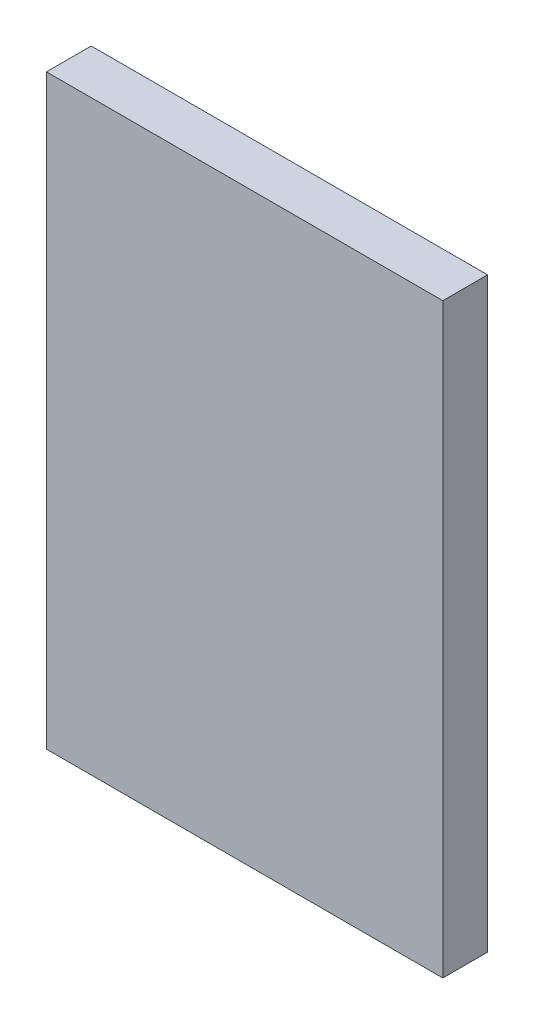
ISO-10303-21;
HEADER;
FILE_DESCRIPTION(('STEP AP214'),'2;1');
FILE_NAME('part.step','',(''),(''),'','','');
FILE_SCHEMA(('AUTOMOTIVE_DESIGN { 1 0 10303 214 1 1 1 1 }'));
ENDSEC;
DATA;
#1=APPLICATION_CONTEXT('core data for automotive mechanical design processes');
#2=APPLICATION_PROTOCOL_DEFINITION('international standard','automotive_design',2000,#1);
#3=PRODUCT_CONTEXT('',#1,'mechanical');
#4=PRODUCT('Part','Part','',(#3));
#5=PRODUCT_RELATED_PRODUCT_CATEGORY('part','',(#4));
#6=PRODUCT_DEFINITION_FORMATION('','',#4);
#7=PRODUCT_DEFINITION_CONTEXT('part definition',#1,'design');
#8=PRODUCT_DEFINITION('design','',#6,#7);
#9=PRODUCT_DEFINITION_SHAPE('','',#8);
#10=(LENGTH_UNIT() NAMED_UNIT(*) SI_UNIT(.MILLI.,.METRE.));
#11=(NAMED_UNIT(*) PLANE_ANGLE_UNIT() SI_UNIT($,.RADIAN.));
#12=(NAMED_UNIT(*) SI_UNIT($,.STERADIAN.) SOLID_ANGLE_UNIT());
#13=UNCERTAINTY_MEASURE_WITH_UNIT(LENGTH_MEASURE(1.E-05),#10,'distance_accuracy_value','');
#14=(GEOMETRIC_REPRESENTATION_CONTEXT(3) GLOBAL_UNCERTAINTY_ASSIGNED_CONTEXT((#13)) GLOBAL_UNIT_ASSIGNED_CONTEXT((#10,
#11,#12)) REPRESENTATION_CONTEXT('',''));
#15=CARTESIAN_POINT('',(0.,0.,0.));
#16=DIRECTION('',(0.,0.,1.));
#17=DIRECTION('',(1.,0.,0.));
#18=AXIS2_PLACEMENT_3D('',#15,#16,#17);
#19=CARTESIAN_POINT('',(225.,333.,50.8));
#20=DIRECTION('',(-1.,0.,0.));
#21=DIRECTION('',(0.,-1.,0.));
#22=AXIS2_PLACEMENT_3D('',#19,#20,#21);
#23=PLANE('',#22);
#24=DIRECTION('',(0.,1.,0.));
#25=VECTOR('',#24,1.);
#26=CARTESIAN_POINT('',(225.,333.,0.));
#27=LINE('',#26,#25);
#28=CARTESIAN_POINT('',(225.,-333.,0.));
#29=VERTEX_POINT('',#28);
#30=CARTESIAN_POINT('',(225.,333.,0.));
#31=VERTEX_POINT('',#30);
#32=EDGE_CURVE('E96',#29,#31,#27,.T.);
#33=ORIENTED_EDGE('',*,*,#32,.T.);
#34=DIRECTION('',(0.,0.,-1.));
#35=VECTOR('',#34,1.);
#36=CARTESIAN_POINT('',(225.,333.,50.8));
#37=LINE('',#36,#35);
#38=CARTESIAN_POINT('',(225.,333.,50.8));
#39=VERTEX_POINT('',#38);
#40=EDGE_CURVE('E11',#39,#31,#37,.T.);
#41=ORIENTED_EDGE('',*,*,#40,.F.);
#42=DIRECTION('',(0.,1.,0.));
#43=VECTOR('',#42,1.);
#44=CARTESIAN_POINT('',(225.,333.,50.8));
#45=LINE('',#44,#43);
#46=CARTESIAN_POINT('',(225.,-333.,50.8));
#47=VERTEX_POINT('',#46);
#48=EDGE_CURVE('E84',#47,#39,#45,.T.);
#49=ORIENTED_EDGE('',*,*,#48,.F.);
#50=DIRECTION('',(0.,0.,-1.));
#51=VECTOR('',#50,1.);
#52=CARTESIAN_POINT('',(225.,-333.,50.8));
#53=LINE('',#52,#51);
#54=EDGE_CURVE('E92',#47,#29,#53,.T.);
#55=ORIENTED_EDGE('',*,*,#54,.T.);
#56=EDGE_LOOP('',(#33,#41,#49,#55));
#57=FACE_BOUND('',#56,.T.);
#58=ADVANCED_FACE('F33',(#57),#23,.F.);
#59=CARTESIAN_POINT('',(-225.,333.,50.8));
#60=DIRECTION('',(0.,-1.,0.));
#61=DIRECTION('',(0.,0.,-1.));
#62=AXIS2_PLACEMENT_3D('',#59,#60,#61);
#63=PLANE('',#62);
#64=DIRECTION('',(-1.,0.,0.));
#65=VECTOR('',#64,1.);
#66=CARTESIAN_POINT('',(-225.,333.,0.));
#67=LINE('',#66,#65);
#68=CARTESIAN_POINT('',(-225.,333.,0.));
#69=VERTEX_POINT('',#68);
#70=EDGE_CURVE('E88',#31,#69,#67,.T.);
#71=ORIENTED_EDGE('',*,*,#70,.T.);
#72=DIRECTION('',(0.,0.,-1.));
#73=VECTOR('',#72,1.);
#74=CARTESIAN_POINT('',(-225.,333.,50.8));
#75=LINE('',#74,#73);
#76=CARTESIAN_POINT('',(-225.,333.,50.8));
#77=VERTEX_POINT('',#76);
#78=EDGE_CURVE('E41',#77,#69,#75,.T.);
#79=ORIENTED_EDGE('',*,*,#78,.F.);
#80=DIRECTION('',(-1.,0.,0.));
#81=VECTOR('',#80,1.);
#82=CARTESIAN_POINT('',(-225.,333.,50.8));
#83=LINE('',#82,#81);
#84=EDGE_CURVE('E79',#39,#77,#83,.T.);
#85=ORIENTED_EDGE('',*,*,#84,.F.);
#86=ORIENTED_EDGE('',*,*,#40,.T.);
#87=EDGE_LOOP('',(#71,#79,#85,#86));
#88=FACE_BOUND('',#87,.T.);
#89=ADVANCED_FACE('F87',(#88),#63,.F.);
#90=CARTESIAN_POINT('',(-225.,333.,50.8));
#91=DIRECTION('',(1.,0.,0.));
#92=DIRECTION('',(0.,1.,0.));
#93=AXIS2_PLACEMENT_3D('',#90,#91,#92);
#94=PLANE('',#93);
#95=DIRECTION('',(0.,-1.,0.));
#96=VECTOR('',#95,1.);
#97=CARTESIAN_POINT('',(-225.,333.,0.));
#98=LINE('',#97,#96);
#99=CARTESIAN_POINT('',(-225.,-333.,0.));
#100=VERTEX_POINT('',#99);
#101=EDGE_CURVE('E66',#69,#100,#98,.T.);
#102=ORIENTED_EDGE('',*,*,#101,.T.);
#103=DIRECTION('',(0.,0.,-1.));
#104=VECTOR('',#103,1.);
#105=CARTESIAN_POINT('',(-225.,-333.,50.8));
#106=LINE('',#105,#104);
#107=CARTESIAN_POINT('',(-225.,-333.,50.8));
#108=VERTEX_POINT('',#107);
#109=EDGE_CURVE('E89',#108,#100,#106,.T.);
#110=ORIENTED_EDGE('',*,*,#109,.F.);
#111=DIRECTION('',(0.,-1.,0.));
#112=VECTOR('',#111,1.);
#113=CARTESIAN_POINT('',(-225.,333.,50.8));
#114=LINE('',#113,#112);
#115=EDGE_CURVE('E82',#77,#108,#114,.T.);
#116=ORIENTED_EDGE('',*,*,#115,.F.);
#117=ORIENTED_EDGE('',*,*,#78,.T.);
#118=EDGE_LOOP('',(#102,#110,#116,#117));
#119=FACE_BOUND('',#118,.T.);
#120=ADVANCED_FACE('F90',(#119),#94,.F.);
#121=CARTESIAN_POINT('',(-225.,-333.,50.8));
#122=DIRECTION('',(0.,1.,0.));
#123=DIRECTION('',(0.,0.,1.));
#124=AXIS2_PLACEMENT_3D('',#121,#122,#123);
#125=PLANE('',#124);
#126=DIRECTION('',(1.,0.,0.));
#127=VECTOR('',#126,1.);
#128=CARTESIAN_POINT('',(-225.,-333.,0.));
#129=LINE('',#128,#127);
#130=EDGE_CURVE('E72',#100,#29,#129,.T.);
#131=ORIENTED_EDGE('',*,*,#130,.T.);
#132=ORIENTED_EDGE('',*,*,#54,.F.);
#133=DIRECTION('',(1.,0.,0.));
#134=VECTOR('',#133,1.);
#135=CARTESIAN_POINT('',(-225.,-333.,50.8));
#136=LINE('',#135,#134);
#137=EDGE_CURVE('E49',#108,#47,#136,.T.);
#138=ORIENTED_EDGE('',*,*,#137,.F.);
#139=ORIENTED_EDGE('',*,*,#109,.T.);
#140=EDGE_LOOP('',(#131,#132,#138,#139));
#141=FACE_BOUND('',#140,.T.);
#142=ADVANCED_FACE('F103',(#141),#125,.F.);
#143=CARTESIAN_POINT('',(0.,0.,50.8));
#144=DIRECTION('',(0.,0.,1.));
#145=DIRECTION('',(1.,0.,0.));
#146=AXIS2_PLACEMENT_3D('',#143,#144,#145);
#147=PLANE('',#146);
#148=ORIENTED_EDGE('',*,*,#48,.T.);
#149=ORIENTED_EDGE('',*,*,#84,.T.);
#150=ORIENTED_EDGE('',*,*,#115,.T.);
#151=ORIENTED_EDGE('',*,*,#137,.T.);
#152=EDGE_LOOP('',(#148,#149,#150,#151));
#153=FACE_BOUND('',#152,.T.);
#154=ADVANCED_FACE('F80',(#153),#147,.T.);
#155=CARTESIAN_POINT('',(0.,0.,0.));
#156=DIRECTION('',(0.,0.,1.));
#157=DIRECTION('',(1.,0.,0.));
#158=AXIS2_PLACEMENT_3D('',#155,#156,#157);
#159=PLANE('',#158);
#160=ORIENTED_EDGE('',*,*,#32,.F.);
#161=ORIENTED_EDGE('',*,*,#130,.F.);
#162=ORIENTED_EDGE('',*,*,#101,.F.);
#163=ORIENTED_EDGE('',*,*,#70,.F.);
#164=EDGE_LOOP('',(#160,#161,#162,#163));
#165=FACE_BOUND('',#164,.T.);
#166=ADVANCED_FACE('F106',(#165),#159,.F.);
#167=CLOSED_SHELL('',(#58,#89,#120,#142,#154,#166));
#168=MANIFOLD_SOLID_BREP('B2',#167);
#169=ADVANCED_BREP_SHAPE_REPRESENTATION('',(#18,#168),#14);
#170=SHAPE_DEFINITION_REPRESENTATION(#9,#169);
ENDSEC;
END-ISO-10303-21;
